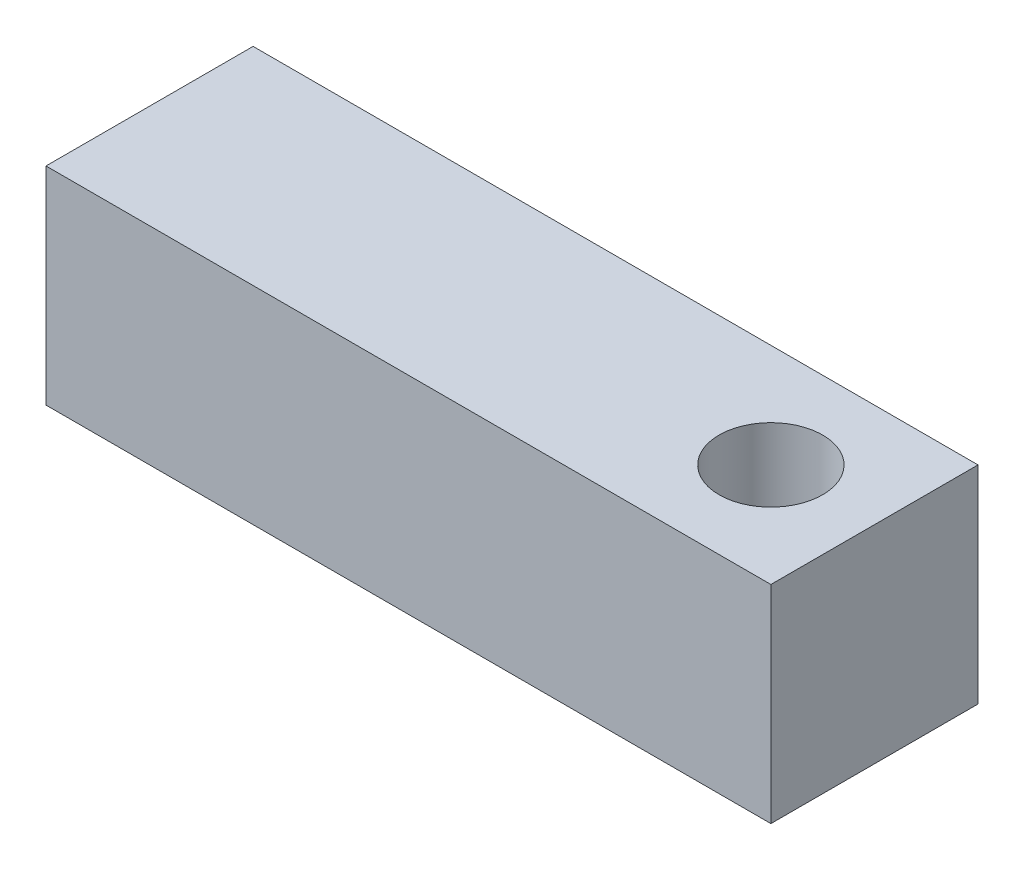
ISO-10303-21;
HEADER;
FILE_DESCRIPTION(('STEP AP214'),'2;1');
FILE_NAME('part.step','',(''),(''),'','','');
FILE_SCHEMA(('AUTOMOTIVE_DESIGN { 1 0 10303 214 1 1 1 1 }'));
ENDSEC;
DATA;
#1=APPLICATION_CONTEXT('core data for automotive mechanical design processes');
#2=APPLICATION_PROTOCOL_DEFINITION('international standard','automotive_design',2000,#1);
#3=PRODUCT_CONTEXT('',#1,'mechanical');
#4=PRODUCT('Part','Part','',(#3));
#5=PRODUCT_RELATED_PRODUCT_CATEGORY('part','',(#4));
#6=PRODUCT_DEFINITION_FORMATION('','',#4);
#7=PRODUCT_DEFINITION_CONTEXT('part definition',#1,'design');
#8=PRODUCT_DEFINITION('design','',#6,#7);
#9=PRODUCT_DEFINITION_SHAPE('','',#8);
#10=(LENGTH_UNIT() NAMED_UNIT(*) SI_UNIT(.MILLI.,.METRE.));
#11=(NAMED_UNIT(*) PLANE_ANGLE_UNIT() SI_UNIT($,.RADIAN.));
#12=(NAMED_UNIT(*) SI_UNIT($,.STERADIAN.) SOLID_ANGLE_UNIT());
#13=UNCERTAINTY_MEASURE_WITH_UNIT(LENGTH_MEASURE(1.E-05),#10,'distance_accuracy_value','');
#14=(GEOMETRIC_REPRESENTATION_CONTEXT(3) GLOBAL_UNCERTAINTY_ASSIGNED_CONTEXT((#13)) GLOBAL_UNIT_ASSIGNED_CONTEXT((#10,
#11,#12)) REPRESENTATION_CONTEXT('',''));
#15=CARTESIAN_POINT('',(0.,0.,0.));
#16=DIRECTION('',(0.,0.,1.));
#17=DIRECTION('',(1.,0.,0.));
#18=AXIS2_PLACEMENT_3D('',#15,#16,#17);
#19=CARTESIAN_POINT('',(0.,25.4,0.));
#20=DIRECTION('',(0.,-1.,0.));
#21=DIRECTION('',(0.,0.,-1.));
#22=AXIS2_PLACEMENT_3D('',#19,#20,#21);
#23=PLANE('',#22);
#24=DIRECTION('',(0.,0.,1.));
#25=VECTOR('',#24,1.);
#26=CARTESIAN_POINT('',(-14.4605144642407,25.4,0.));
#27=LINE('',#26,#25);
#28=CARTESIAN_POINT('',(-14.4605144642407,25.4,-25.4));
#29=VERTEX_POINT('',#28);
#30=CARTESIAN_POINT('',(-14.4605144642407,25.4,0.));
#31=VERTEX_POINT('',#30);
#32=EDGE_CURVE('E84',#29,#31,#27,.T.);
#33=ORIENTED_EDGE('',*,*,#32,.T.);
#34=DIRECTION('',(1.,0.,0.));
#35=VECTOR('',#34,1.);
#36=CARTESIAN_POINT('',(-14.4605144642407,25.4,0.));
#37=LINE('',#36,#35);
#38=CARTESIAN_POINT('',(74.4394855357593,25.4,0.));
#39=VERTEX_POINT('',#38);
#40=EDGE_CURVE('E79',#31,#39,#37,.T.);
#41=ORIENTED_EDGE('',*,*,#40,.T.);
#42=DIRECTION('',(0.,0.,-1.));
#43=VECTOR('',#42,1.);
#44=CARTESIAN_POINT('',(74.4394855357593,25.4,0.));
#45=LINE('',#44,#43);
#46=CARTESIAN_POINT('',(74.4394855357593,25.4,-25.4));
#47=VERTEX_POINT('',#46);
#48=EDGE_CURVE('E82',#39,#47,#45,.T.);
#49=ORIENTED_EDGE('',*,*,#48,.T.);
#50=DIRECTION('',(-1.,0.,0.));
#51=VECTOR('',#50,1.);
#52=CARTESIAN_POINT('',(-14.4605144642407,25.4,-25.4));
#53=LINE('',#52,#51);
#54=EDGE_CURVE('E49',#47,#29,#53,.T.);
#55=ORIENTED_EDGE('',*,*,#54,.T.);
#56=EDGE_LOOP('',(#33,#41,#49,#55));
#57=FACE_BOUND('',#56,.T.);
#58=CARTESIAN_POINT('',(61.7394855357593,25.4,-12.7));
#59=DIRECTION('',(0.,1.,0.));
#60=DIRECTION('',(0.,0.,1.));
#61=AXIS2_PLACEMENT_3D('',#58,#59,#60);
#62=CIRCLE('',#61,6.35);
#63=CARTESIAN_POINT('',(61.7394855357593,25.4,-6.35));
#64=VERTEX_POINT('',#63);
#65=EDGE_CURVE('E99',#64,#64,#62,.T.);
#66=ORIENTED_EDGE('',*,*,#65,.F.);
#67=EDGE_LOOP('',(#66));
#68=FACE_BOUND('',#67,.T.);
#69=ADVANCED_FACE('F32',(#57,#68),#23,.F.);
#70=CARTESIAN_POINT('',(0.,0.,0.));
#71=DIRECTION('',(0.,-1.,0.));
#72=DIRECTION('',(0.,0.,-1.));
#73=AXIS2_PLACEMENT_3D('',#70,#71,#72);
#74=PLANE('',#73);
#75=DIRECTION('',(0.,0.,1.));
#76=VECTOR('',#75,1.);
#77=CARTESIAN_POINT('',(-14.4605144642407,0.,0.));
#78=LINE('',#77,#76);
#79=CARTESIAN_POINT('',(-14.4605144642407,0.,-25.4));
#80=VERTEX_POINT('',#79);
#81=CARTESIAN_POINT('',(-14.4605144642407,0.,0.));
#82=VERTEX_POINT('',#81);
#83=EDGE_CURVE('E96',#80,#82,#78,.T.);
#84=ORIENTED_EDGE('',*,*,#83,.F.);
#85=DIRECTION('',(-1.,0.,0.));
#86=VECTOR('',#85,1.);
#87=CARTESIAN_POINT('',(-14.4605144642407,0.,-25.4));
#88=LINE('',#87,#86);
#89=CARTESIAN_POINT('',(74.4394855357593,0.,-25.4));
#90=VERTEX_POINT('',#89);
#91=EDGE_CURVE('E72',#90,#80,#88,.T.);
#92=ORIENTED_EDGE('',*,*,#91,.F.);
#93=DIRECTION('',(0.,0.,-1.));
#94=VECTOR('',#93,1.);
#95=CARTESIAN_POINT('',(74.4394855357593,0.,0.));
#96=LINE('',#95,#94);
#97=CARTESIAN_POINT('',(74.4394855357593,0.,0.));
#98=VERTEX_POINT('',#97);
#99=EDGE_CURVE('E66',#98,#90,#96,.T.);
#100=ORIENTED_EDGE('',*,*,#99,.F.);
#101=DIRECTION('',(1.,0.,0.));
#102=VECTOR('',#101,1.);
#103=CARTESIAN_POINT('',(-14.4605144642407,0.,0.));
#104=LINE('',#103,#102);
#105=EDGE_CURVE('E88',#82,#98,#104,.T.);
#106=ORIENTED_EDGE('',*,*,#105,.F.);
#107=EDGE_LOOP('',(#84,#92,#100,#106));
#108=FACE_BOUND('',#107,.T.);
#109=CARTESIAN_POINT('',(61.7394855357593,0.,-12.7));
#110=DIRECTION('',(0.,1.,0.));
#111=DIRECTION('',(0.,0.,1.));
#112=AXIS2_PLACEMENT_3D('',#109,#110,#111);
#113=CIRCLE('',#112,6.35);
#114=CARTESIAN_POINT('',(61.7394855357593,0.,-6.35));
#115=VERTEX_POINT('',#114);
#116=EDGE_CURVE('E111',#115,#115,#113,.T.);
#117=ORIENTED_EDGE('',*,*,#116,.T.);
#118=EDGE_LOOP('',(#117));
#119=FACE_BOUND('',#118,.T.);
#120=ADVANCED_FACE('F107',(#108,#119),#74,.T.);
#121=CARTESIAN_POINT('',(-14.4605144642407,25.4,0.));
#122=DIRECTION('',(1.,0.,0.));
#123=DIRECTION('',(0.,0.,-1.));
#124=AXIS2_PLACEMENT_3D('',#121,#122,#123);
#125=PLANE('',#124);
#126=ORIENTED_EDGE('',*,*,#83,.T.);
#127=DIRECTION('',(0.,-1.,0.));
#128=VECTOR('',#127,1.);
#129=CARTESIAN_POINT('',(-14.4605144642407,25.4,0.));
#130=LINE('',#129,#128);
#131=EDGE_CURVE('E11',#31,#82,#130,.T.);
#132=ORIENTED_EDGE('',*,*,#131,.F.);
#133=ORIENTED_EDGE('',*,*,#32,.F.);
#134=DIRECTION('',(0.,-1.,0.));
#135=VECTOR('',#134,1.);
#136=CARTESIAN_POINT('',(-14.4605144642407,25.4,-25.4));
#137=LINE('',#136,#135);
#138=EDGE_CURVE('E92',#29,#80,#137,.T.);
#139=ORIENTED_EDGE('',*,*,#138,.T.);
#140=EDGE_LOOP('',(#126,#132,#133,#139));
#141=FACE_BOUND('',#140,.T.);
#142=ADVANCED_FACE('F34',(#141),#125,.F.);
#143=CARTESIAN_POINT('',(-14.4605144642407,25.4,0.));
#144=DIRECTION('',(0.,0.,-1.));
#145=DIRECTION('',(-1.,0.,0.));
#146=AXIS2_PLACEMENT_3D('',#143,#144,#145);
#147=PLANE('',#146);
#148=ORIENTED_EDGE('',*,*,#105,.T.);
#149=DIRECTION('',(0.,-1.,0.));
#150=VECTOR('',#149,1.);
#151=CARTESIAN_POINT('',(74.4394855357593,25.4,0.));
#152=LINE('',#151,#150);
#153=EDGE_CURVE('E41',#39,#98,#152,.T.);
#154=ORIENTED_EDGE('',*,*,#153,.F.);
#155=ORIENTED_EDGE('',*,*,#40,.F.);
#156=ORIENTED_EDGE('',*,*,#131,.T.);
#157=EDGE_LOOP('',(#148,#154,#155,#156));
#158=FACE_BOUND('',#157,.T.);
#159=ADVANCED_FACE('F87',(#158),#147,.F.);
#160=CARTESIAN_POINT('',(74.4394855357593,25.4,0.));
#161=DIRECTION('',(-1.,0.,0.));
#162=DIRECTION('',(0.,0.,1.));
#163=AXIS2_PLACEMENT_3D('',#160,#161,#162);
#164=PLANE('',#163);
#165=ORIENTED_EDGE('',*,*,#99,.T.);
#166=DIRECTION('',(0.,-1.,0.));
#167=VECTOR('',#166,1.);
#168=CARTESIAN_POINT('',(74.4394855357593,25.4,-25.4));
#169=LINE('',#168,#167);
#170=EDGE_CURVE('E89',#47,#90,#169,.T.);
#171=ORIENTED_EDGE('',*,*,#170,.F.);
#172=ORIENTED_EDGE('',*,*,#48,.F.);
#173=ORIENTED_EDGE('',*,*,#153,.T.);
#174=EDGE_LOOP('',(#165,#171,#172,#173));
#175=FACE_BOUND('',#174,.T.);
#176=ADVANCED_FACE('F90',(#175),#164,.F.);
#177=CARTESIAN_POINT('',(-14.4605144642407,25.4,-25.4));
#178=DIRECTION('',(0.,0.,1.));
#179=DIRECTION('',(1.,0.,0.));
#180=AXIS2_PLACEMENT_3D('',#177,#178,#179);
#181=PLANE('',#180);
#182=ORIENTED_EDGE('',*,*,#91,.T.);
#183=ORIENTED_EDGE('',*,*,#138,.F.);
#184=ORIENTED_EDGE('',*,*,#54,.F.);
#185=ORIENTED_EDGE('',*,*,#170,.T.);
#186=EDGE_LOOP('',(#182,#183,#184,#185));
#187=FACE_BOUND('',#186,.T.);
#188=ADVANCED_FACE('F104',(#187),#181,.F.);
#189=CARTESIAN_POINT('',(61.7394855357593,25.4,-12.7));
#190=DIRECTION('',(0.,-1.,0.));
#191=DIRECTION('',(0.,0.,-1.));
#192=AXIS2_PLACEMENT_3D('',#189,#190,#191);
#193=CYLINDRICAL_SURFACE('',#192,6.35);
#194=ORIENTED_EDGE('',*,*,#65,.T.);
#195=EDGE_LOOP('',(#194));
#196=FACE_BOUND('',#195,.T.);
#197=ORIENTED_EDGE('',*,*,#116,.F.);
#198=EDGE_LOOP('',(#197));
#199=FACE_BOUND('',#198,.T.);
#200=ADVANCED_FACE('F117',(#196,#199),#193,.F.);
#201=CLOSED_SHELL('',(#69,#120,#142,#159,#176,#188,#200));
#202=MANIFOLD_SOLID_BREP('B2',#201);
#203=ADVANCED_BREP_SHAPE_REPRESENTATION('',(#18,#202),#14);
#204=SHAPE_DEFINITION_REPRESENTATION(#9,#203);
ENDSEC;
END-ISO-10303-21;
